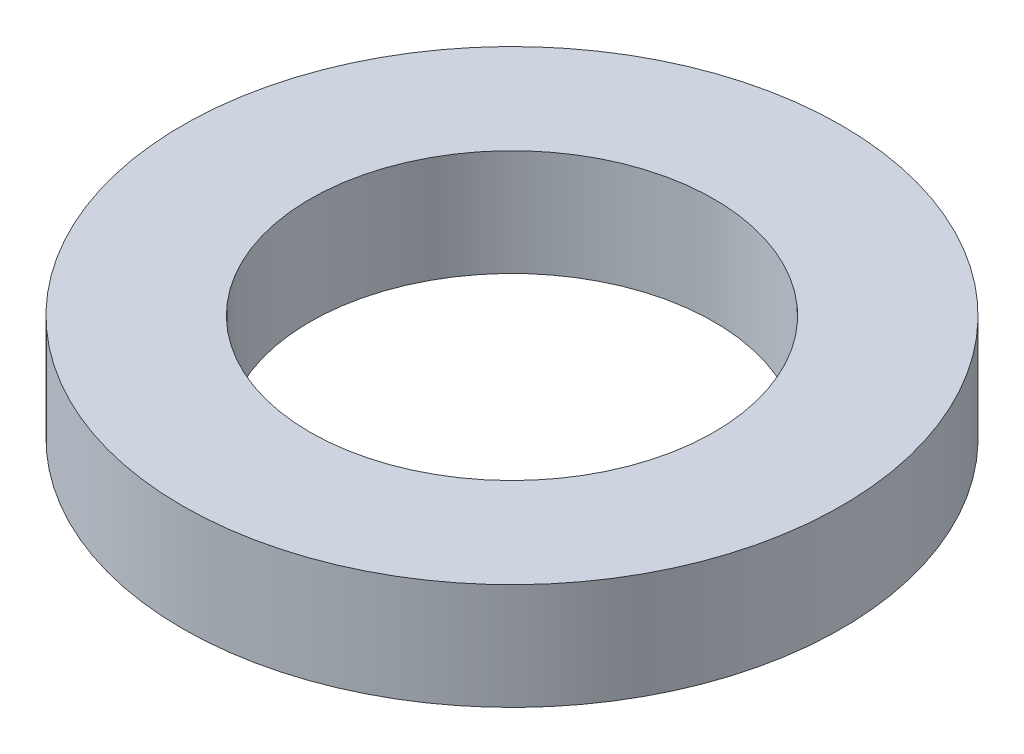
ISO-10303-21;
HEADER;
FILE_DESCRIPTION(('STEP AP214'),'2;1');
FILE_NAME('part.step','',(''),(''),'','','');
FILE_SCHEMA(('AUTOMOTIVE_DESIGN { 1 0 10303 214 1 1 1 1 }'));
ENDSEC;
DATA;
#1=APPLICATION_CONTEXT('core data for automotive mechanical design processes');
#2=APPLICATION_PROTOCOL_DEFINITION('international standard','automotive_design',2000,#1);
#3=PRODUCT_CONTEXT('',#1,'mechanical');
#4=PRODUCT('Part','Part','',(#3));
#5=PRODUCT_RELATED_PRODUCT_CATEGORY('part','',(#4));
#6=PRODUCT_DEFINITION_FORMATION('','',#4);
#7=PRODUCT_DEFINITION_CONTEXT('part definition',#1,'design');
#8=PRODUCT_DEFINITION('design','',#6,#7);
#9=PRODUCT_DEFINITION_SHAPE('','',#8);
#10=(LENGTH_UNIT() NAMED_UNIT(*) SI_UNIT(.MILLI.,.METRE.));
#11=(NAMED_UNIT(*) PLANE_ANGLE_UNIT() SI_UNIT($,.RADIAN.));
#12=(NAMED_UNIT(*) SI_UNIT($,.STERADIAN.) SOLID_ANGLE_UNIT());
#13=UNCERTAINTY_MEASURE_WITH_UNIT(LENGTH_MEASURE(1.E-05),#10,'distance_accuracy_value','');
#14=(GEOMETRIC_REPRESENTATION_CONTEXT(3) GLOBAL_UNCERTAINTY_ASSIGNED_CONTEXT((#13)) GLOBAL_UNIT_ASSIGNED_CONTEXT((#10,
#11,#12)) REPRESENTATION_CONTEXT('',''));
#15=CARTESIAN_POINT('',(0.,0.,0.));
#16=DIRECTION('',(0.,0.,1.));
#17=DIRECTION('',(1.,0.,0.));
#18=AXIS2_PLACEMENT_3D('',#15,#16,#17);
#19=CARTESIAN_POINT('',(0.,25.,0.));
#20=DIRECTION('',(0.,-1.,0.));
#21=DIRECTION('',(0.,0.,-1.));
#22=AXIS2_PLACEMENT_3D('',#19,#20,#21);
#23=CYLINDRICAL_SURFACE('',#22,77.5);
#24=CARTESIAN_POINT('',(0.,25.,0.));
#25=DIRECTION('',(0.,1.,0.));
#26=DIRECTION('',(0.,0.,1.));
#27=AXIS2_PLACEMENT_3D('',#24,#25,#26);
#28=CIRCLE('',#27,77.5);
#29=CARTESIAN_POINT('',(0.,25.,77.5));
#30=VERTEX_POINT('',#29);
#31=EDGE_CURVE('E10',#30,#30,#28,.T.);
#32=ORIENTED_EDGE('',*,*,#31,.F.);
#33=EDGE_LOOP('',(#32));
#34=FACE_BOUND('',#33,.T.);
#35=CARTESIAN_POINT('',(0.,0.,0.));
#36=DIRECTION('',(0.,1.,0.));
#37=DIRECTION('',(0.,0.,1.));
#38=AXIS2_PLACEMENT_3D('',#35,#36,#37);
#39=CIRCLE('',#38,77.5);
#40=CARTESIAN_POINT('',(0.,0.,77.5));
#41=VERTEX_POINT('',#40);
#42=EDGE_CURVE('E37',#41,#41,#39,.T.);
#43=ORIENTED_EDGE('',*,*,#42,.T.);
#44=EDGE_LOOP('',(#43));
#45=FACE_BOUND('',#44,.T.);
#46=ADVANCED_FACE('F40',(#34,#45),#23,.T.);
#47=CARTESIAN_POINT('',(0.,25.,0.));
#48=DIRECTION('',(0.,1.,0.));
#49=DIRECTION('',(0.,0.,1.));
#50=AXIS2_PLACEMENT_3D('',#47,#48,#49);
#51=PLANE('',#50);
#52=CARTESIAN_POINT('',(0.,25.,0.));
#53=DIRECTION('',(0.,1.,0.));
#54=DIRECTION('',(0.,0.,1.));
#55=AXIS2_PLACEMENT_3D('',#52,#53,#54);
#56=CIRCLE('',#55,47.5);
#57=CARTESIAN_POINT('',(0.,25.,47.5));
#58=VERTEX_POINT('',#57);
#59=EDGE_CURVE('E50',#58,#58,#56,.T.);
#60=ORIENTED_EDGE('',*,*,#59,.F.);
#61=EDGE_LOOP('',(#60));
#62=FACE_BOUND('',#61,.T.);
#63=ORIENTED_EDGE('',*,*,#31,.T.);
#64=EDGE_LOOP('',(#63));
#65=FACE_BOUND('',#64,.T.);
#66=ADVANCED_FACE('F59',(#62,#65),#51,.T.);
#67=CARTESIAN_POINT('',(0.,0.,0.));
#68=DIRECTION('',(0.,1.,0.));
#69=DIRECTION('',(0.,0.,1.));
#70=AXIS2_PLACEMENT_3D('',#67,#68,#69);
#71=PLANE('',#70);
#72=CARTESIAN_POINT('',(0.,0.,0.));
#73=DIRECTION('',(0.,1.,0.));
#74=DIRECTION('',(0.,0.,1.));
#75=AXIS2_PLACEMENT_3D('',#72,#73,#74);
#76=CIRCLE('',#75,47.5);
#77=CARTESIAN_POINT('',(0.,0.,47.5));
#78=VERTEX_POINT('',#77);
#79=EDGE_CURVE('E47',#78,#78,#76,.T.);
#80=ORIENTED_EDGE('',*,*,#79,.T.);
#81=EDGE_LOOP('',(#80));
#82=FACE_BOUND('',#81,.T.);
#83=ORIENTED_EDGE('',*,*,#42,.F.);
#84=EDGE_LOOP('',(#83));
#85=FACE_BOUND('',#84,.T.);
#86=ADVANCED_FACE('F58',(#82,#85),#71,.F.);
#87=CARTESIAN_POINT('',(0.,25.,0.));
#88=DIRECTION('',(0.,-1.,0.));
#89=DIRECTION('',(0.,0.,-1.));
#90=AXIS2_PLACEMENT_3D('',#87,#88,#89);
#91=CYLINDRICAL_SURFACE('',#90,47.5);
#92=ORIENTED_EDGE('',*,*,#59,.T.);
#93=EDGE_LOOP('',(#92));
#94=FACE_BOUND('',#93,.T.);
#95=ORIENTED_EDGE('',*,*,#79,.F.);
#96=EDGE_LOOP('',(#95));
#97=FACE_BOUND('',#96,.T.);
#98=ADVANCED_FACE('F54',(#94,#97),#91,.F.);
#99=CLOSED_SHELL('',(#46,#66,#86,#98));
#100=MANIFOLD_SOLID_BREP('B2',#99);
#101=ADVANCED_BREP_SHAPE_REPRESENTATION('',(#18,#100),#14);
#102=SHAPE_DEFINITION_REPRESENTATION(#9,#101);
ENDSEC;
END-ISO-10303-21;
